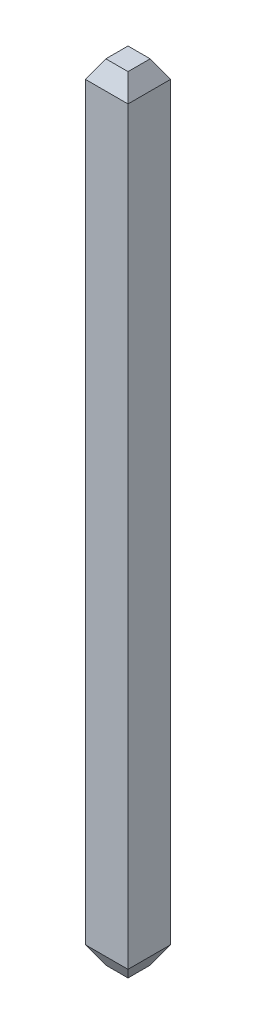
ISO-10303-21;
HEADER;
FILE_DESCRIPTION(('STEP AP214'),'2;1');
FILE_NAME('part.step','',(''),(''),'','','');
FILE_SCHEMA(('AUTOMOTIVE_DESIGN { 1 0 10303 214 1 1 1 1 }'));
ENDSEC;
DATA;
#1=APPLICATION_CONTEXT('core data for automotive mechanical design processes');
#2=APPLICATION_PROTOCOL_DEFINITION('international standard','automotive_design',2000,#1);
#3=PRODUCT_CONTEXT('',#1,'mechanical');
#4=PRODUCT('Part','Part','',(#3));
#5=PRODUCT_RELATED_PRODUCT_CATEGORY('part','',(#4));
#6=PRODUCT_DEFINITION_FORMATION('','',#4);
#7=PRODUCT_DEFINITION_CONTEXT('part definition',#1,'design');
#8=PRODUCT_DEFINITION('design','',#6,#7);
#9=PRODUCT_DEFINITION_SHAPE('','',#8);
#10=(LENGTH_UNIT() NAMED_UNIT(*) SI_UNIT(.MILLI.,.METRE.));
#11=(NAMED_UNIT(*) PLANE_ANGLE_UNIT() SI_UNIT($,.RADIAN.));
#12=(NAMED_UNIT(*) SI_UNIT($,.STERADIAN.) SOLID_ANGLE_UNIT());
#13=UNCERTAINTY_MEASURE_WITH_UNIT(LENGTH_MEASURE(1.E-05),#10,'distance_accuracy_value','');
#14=(GEOMETRIC_REPRESENTATION_CONTEXT(3) GLOBAL_UNCERTAINTY_ASSIGNED_CONTEXT((#13)) GLOBAL_UNIT_ASSIGNED_CONTEXT((#10,
#11,#12)) REPRESENTATION_CONTEXT('',''));
#15=CARTESIAN_POINT('',(0.,0.,0.));
#16=DIRECTION('',(0.,0.,1.));
#17=DIRECTION('',(1.,0.,0.));
#18=AXIS2_PLACEMENT_3D('',#15,#16,#17);
#19=CARTESIAN_POINT('',(2.2225,-5.58,-1.435));
#20=DIRECTION('',(0.,0.50000000000019,0.866025403784329));
#21=DIRECTION('',(1.,0.,0.));
#22=AXIS2_PLACEMENT_3D('',#19,#20,#21);
#23=PLANE('',#22);
#24=DIRECTION('',(-0.44721359550015,0.774596669241261,-0.44721359550015));
#25=VECTOR('',#24,1.);
#26=CARTESIAN_POINT('',(2.375,-5.58,-1.435));
#27=LINE('',#26,#25);
#28=CARTESIAN_POINT('',(2.375,-5.58,-1.435));
#29=VERTEX_POINT('',#28);
#30=CARTESIAN_POINT('',(2.2225,-5.31586225185,-1.5875));
#31=VERTEX_POINT('',#30);
#32=EDGE_CURVE('E161',#29,#31,#27,.T.);
#33=ORIENTED_EDGE('',*,*,#32,.T.);
#34=DIRECTION('',(1.,0.,0.));
#35=VECTOR('',#34,1.);
#36=CARTESIAN_POINT('',(2.2225,-5.31586225185,-1.5875));
#37=LINE('',#36,#35);
#38=CARTESIAN_POINT('',(2.8575,-5.31586225185,-1.5875));
#39=VERTEX_POINT('',#38);
#40=EDGE_CURVE('E148',#31,#39,#37,.T.);
#41=ORIENTED_EDGE('',*,*,#40,.T.);
#42=DIRECTION('',(0.44721359550015,0.774596669241261,-0.44721359550015));
#43=VECTOR('',#42,1.);
#44=CARTESIAN_POINT('',(2.705,-5.58,-1.435));
#45=LINE('',#44,#43);
#46=CARTESIAN_POINT('',(2.705,-5.58,-1.435));
#47=VERTEX_POINT('',#46);
#48=EDGE_CURVE('E27',#47,#39,#45,.T.);
#49=ORIENTED_EDGE('',*,*,#48,.F.);
#50=DIRECTION('',(1.,0.,0.));
#51=VECTOR('',#50,1.);
#52=CARTESIAN_POINT('',(2.375,-5.58,-1.435));
#53=LINE('',#52,#51);
#54=EDGE_CURVE('E156',#29,#47,#53,.T.);
#55=ORIENTED_EDGE('',*,*,#54,.F.);
#56=EDGE_LOOP('',(#33,#41,#49,#55));
#57=FACE_BOUND('',#56,.T.);
#58=ADVANCED_FACE('F16',(#57),#23,.F.);
#59=CARTESIAN_POINT('',(2.8575,-5.58,-1.105));
#60=DIRECTION('',(0.,0.50000000000019,-0.866025403784329));
#61=DIRECTION('',(-1.,0.,0.));
#62=AXIS2_PLACEMENT_3D('',#59,#60,#61);
#63=PLANE('',#62);
#64=DIRECTION('',(0.44721359550015,0.774596669241261,0.44721359550015));
#65=VECTOR('',#64,1.);
#66=CARTESIAN_POINT('',(2.705,-5.58,-1.105));
#67=LINE('',#66,#65);
#68=CARTESIAN_POINT('',(2.705,-5.58,-1.105));
#69=VERTEX_POINT('',#68);
#70=CARTESIAN_POINT('',(2.8575,-5.31586225185,-0.9525));
#71=VERTEX_POINT('',#70);
#72=EDGE_CURVE('E11',#69,#71,#67,.T.);
#73=ORIENTED_EDGE('',*,*,#72,.T.);
#74=DIRECTION('',(-1.,0.,0.));
#75=VECTOR('',#74,1.);
#76=CARTESIAN_POINT('',(2.8575,-5.31586225185,-0.9525));
#77=LINE('',#76,#75);
#78=CARTESIAN_POINT('',(2.2225,-5.31586225185,-0.9525));
#79=VERTEX_POINT('',#78);
#80=EDGE_CURVE('E209',#71,#79,#77,.T.);
#81=ORIENTED_EDGE('',*,*,#80,.T.);
#82=DIRECTION('',(-0.44721359550015,0.774596669241261,0.44721359550015));
#83=VECTOR('',#82,1.);
#84=CARTESIAN_POINT('',(2.375,-5.58,-1.105));
#85=LINE('',#84,#83);
#86=CARTESIAN_POINT('',(2.375,-5.58,-1.105));
#87=VERTEX_POINT('',#86);
#88=EDGE_CURVE('E165',#87,#79,#85,.T.);
#89=ORIENTED_EDGE('',*,*,#88,.F.);
#90=DIRECTION('',(-1.,0.,0.));
#91=VECTOR('',#90,1.);
#92=CARTESIAN_POINT('',(2.705,-5.58,-1.105));
#93=LINE('',#92,#91);
#94=EDGE_CURVE('E152',#69,#87,#93,.T.);
#95=ORIENTED_EDGE('',*,*,#94,.F.);
#96=EDGE_LOOP('',(#73,#81,#89,#95));
#97=FACE_BOUND('',#96,.T.);
#98=ADVANCED_FACE('F431',(#97),#63,.F.);
#99=CARTESIAN_POINT('',(2.705,-5.58,-1.5875));
#100=DIRECTION('',(-0.866025403784329,0.50000000000019,0.));
#101=DIRECTION('',(0.,0.,1.));
#102=AXIS2_PLACEMENT_3D('',#99,#100,#101);
#103=PLANE('',#102);
#104=ORIENTED_EDGE('',*,*,#48,.T.);
#105=DIRECTION('',(0.,0.,1.));
#106=VECTOR('',#105,1.);
#107=CARTESIAN_POINT('',(2.8575,-5.31586225185,-1.5875));
#108=LINE('',#107,#106);
#109=EDGE_CURVE('E20',#39,#71,#108,.T.);
#110=ORIENTED_EDGE('',*,*,#109,.T.);
#111=ORIENTED_EDGE('',*,*,#72,.F.);
#112=DIRECTION('',(0.,0.,1.));
#113=VECTOR('',#112,1.);
#114=CARTESIAN_POINT('',(2.705,-5.58,-1.435));
#115=LINE('',#114,#113);
#116=EDGE_CURVE('E166',#47,#69,#115,.T.);
#117=ORIENTED_EDGE('',*,*,#116,.F.);
#118=EDGE_LOOP('',(#104,#110,#111,#117));
#119=FACE_BOUND('',#118,.T.);
#120=ADVANCED_FACE('F18',(#119),#103,.F.);
#121=CARTESIAN_POINT('',(2.54,-5.58,-1.27));
#122=DIRECTION('',(0.,-1.,0.));
#123=DIRECTION('',(0.,0.,-1.));
#124=AXIS2_PLACEMENT_3D('',#121,#122,#123);
#125=PLANE('',#124);
#126=ORIENTED_EDGE('',*,*,#94,.T.);
#127=DIRECTION('',(0.,0.,-1.));
#128=VECTOR('',#127,1.);
#129=CARTESIAN_POINT('',(2.375,-5.58,-1.105));
#130=LINE('',#129,#128);
#131=EDGE_CURVE('E157',#87,#29,#130,.T.);
#132=ORIENTED_EDGE('',*,*,#131,.T.);
#133=ORIENTED_EDGE('',*,*,#54,.T.);
#134=ORIENTED_EDGE('',*,*,#116,.T.);
#135=EDGE_LOOP('',(#126,#132,#133,#134));
#136=FACE_BOUND('',#135,.T.);
#137=ADVANCED_FACE('F184',(#136),#125,.T.);
#138=CARTESIAN_POINT('',(2.375,-5.58,-0.9525));
#139=DIRECTION('',(0.866025403784329,0.50000000000019,0.));
#140=DIRECTION('',(0.,0.,-1.));
#141=AXIS2_PLACEMENT_3D('',#138,#139,#140);
#142=PLANE('',#141);
#143=ORIENTED_EDGE('',*,*,#88,.T.);
#144=DIRECTION('',(0.,0.,-1.));
#145=VECTOR('',#144,1.);
#146=CARTESIAN_POINT('',(2.2225,-5.31586225185,-0.9525));
#147=LINE('',#146,#145);
#148=EDGE_CURVE('E170',#79,#31,#147,.T.);
#149=ORIENTED_EDGE('',*,*,#148,.T.);
#150=ORIENTED_EDGE('',*,*,#32,.F.);
#151=ORIENTED_EDGE('',*,*,#131,.F.);
#152=EDGE_LOOP('',(#143,#149,#150,#151));
#153=FACE_BOUND('',#152,.T.);
#154=ADVANCED_FACE('F188',(#153),#142,.F.);
#155=CARTESIAN_POINT('',(2.2225,6.1,-0.9525));
#156=DIRECTION('',(-1.,0.,0.));
#157=DIRECTION('',(0.,0.,1.));
#158=AXIS2_PLACEMENT_3D('',#155,#156,#157);
#159=PLANE('',#158);
#160=DIRECTION('',(0.,-1.,0.));
#161=VECTOR('',#160,1.);
#162=CARTESIAN_POINT('',(2.2225,5.835862251846,-1.5875));
#163=LINE('',#162,#161);
#164=CARTESIAN_POINT('',(2.2225,5.835862251846,-1.5875));
#165=VERTEX_POINT('',#164);
#166=EDGE_CURVE('E79',#165,#31,#163,.T.);
#167=ORIENTED_EDGE('',*,*,#166,.T.);
#168=ORIENTED_EDGE('',*,*,#148,.F.);
#169=DIRECTION('',(0.,-1.,0.));
#170=VECTOR('',#169,1.);
#171=CARTESIAN_POINT('',(2.2225,5.835862251846,-0.9525));
#172=LINE('',#171,#170);
#173=CARTESIAN_POINT('',(2.2225,5.835862251846,-0.9525));
#174=VERTEX_POINT('',#173);
#175=EDGE_CURVE('E63',#174,#79,#172,.T.);
#176=ORIENTED_EDGE('',*,*,#175,.F.);
#177=DIRECTION('',(0.,0.,-1.));
#178=VECTOR('',#177,1.);
#179=CARTESIAN_POINT('',(2.2225,5.835862251846,-0.9525));
#180=LINE('',#179,#178);
#181=EDGE_CURVE('E175',#174,#165,#180,.T.);
#182=ORIENTED_EDGE('',*,*,#181,.T.);
#183=EDGE_LOOP('',(#167,#168,#176,#182));
#184=FACE_BOUND('',#183,.T.);
#185=ADVANCED_FACE('F398',(#184),#159,.T.);
#186=CARTESIAN_POINT('',(2.2225,6.1,-1.5875));
#187=DIRECTION('',(0.,0.,-1.));
#188=DIRECTION('',(0.,-1.,0.));
#189=AXIS2_PLACEMENT_3D('',#186,#187,#188);
#190=PLANE('',#189);
#191=DIRECTION('',(0.,-1.,0.));
#192=VECTOR('',#191,1.);
#193=CARTESIAN_POINT('',(2.8575,5.835862251846,-1.5875));
#194=LINE('',#193,#192);
#195=CARTESIAN_POINT('',(2.8575,5.835862251846,-1.5875));
#196=VERTEX_POINT('',#195);
#197=EDGE_CURVE('E151',#196,#39,#194,.T.);
#198=ORIENTED_EDGE('',*,*,#197,.T.);
#199=ORIENTED_EDGE('',*,*,#40,.F.);
#200=ORIENTED_EDGE('',*,*,#166,.F.);
#201=DIRECTION('',(1.,0.,0.));
#202=VECTOR('',#201,1.);
#203=CARTESIAN_POINT('',(2.2225,5.835862251846,-1.5875));
#204=LINE('',#203,#202);
#205=EDGE_CURVE('E117',#165,#196,#204,.T.);
#206=ORIENTED_EDGE('',*,*,#205,.T.);
#207=EDGE_LOOP('',(#198,#199,#200,#206));
#208=FACE_BOUND('',#207,.T.);
#209=ADVANCED_FACE('F241',(#208),#190,.T.);
#210=CARTESIAN_POINT('',(2.8575,6.1,-1.5875));
#211=DIRECTION('',(1.,0.,0.));
#212=DIRECTION('',(0.,1.,0.));
#213=AXIS2_PLACEMENT_3D('',#210,#211,#212);
#214=PLANE('',#213);
#215=DIRECTION('',(0.,-1.,0.));
#216=VECTOR('',#215,1.);
#217=CARTESIAN_POINT('',(2.8575,5.835862251846,-0.9525));
#218=LINE('',#217,#216);
#219=CARTESIAN_POINT('',(2.8575,5.835862251846,-0.9525));
#220=VERTEX_POINT('',#219);
#221=EDGE_CURVE('E205',#220,#71,#218,.T.);
#222=ORIENTED_EDGE('',*,*,#221,.T.);
#223=ORIENTED_EDGE('',*,*,#109,.F.);
#224=ORIENTED_EDGE('',*,*,#197,.F.);
#225=DIRECTION('',(0.,0.,1.));
#226=VECTOR('',#225,1.);
#227=CARTESIAN_POINT('',(2.8575,5.835862251846,-1.5875));
#228=LINE('',#227,#226);
#229=EDGE_CURVE('E112',#196,#220,#228,.T.);
#230=ORIENTED_EDGE('',*,*,#229,.T.);
#231=EDGE_LOOP('',(#222,#223,#224,#230));
#232=FACE_BOUND('',#231,.T.);
#233=ADVANCED_FACE('F216',(#232),#214,.T.);
#234=CARTESIAN_POINT('',(2.8575,6.1,-0.9525));
#235=DIRECTION('',(0.,0.,1.));
#236=DIRECTION('',(1.,0.,0.));
#237=AXIS2_PLACEMENT_3D('',#234,#235,#236);
#238=PLANE('',#237);
#239=ORIENTED_EDGE('',*,*,#175,.T.);
#240=ORIENTED_EDGE('',*,*,#80,.F.);
#241=ORIENTED_EDGE('',*,*,#221,.F.);
#242=DIRECTION('',(-1.,0.,0.));
#243=VECTOR('',#242,1.);
#244=CARTESIAN_POINT('',(2.8575,5.835862251846,-0.9525));
#245=LINE('',#244,#243);
#246=EDGE_CURVE('E141',#220,#174,#245,.T.);
#247=ORIENTED_EDGE('',*,*,#246,.T.);
#248=EDGE_LOOP('',(#239,#240,#241,#247));
#249=FACE_BOUND('',#248,.T.);
#250=ADVANCED_FACE('F207',(#249),#238,.T.);
#251=CARTESIAN_POINT('',(2.8575,6.1,-1.105));
#252=DIRECTION('',(0.,0.50000000000019,0.866025403784329));
#253=DIRECTION('',(1.,0.,0.));
#254=AXIS2_PLACEMENT_3D('',#251,#252,#253);
#255=PLANE('',#254);
#256=DIRECTION('',(-0.44721359550015,-0.774596669241261,0.44721359550015));
#257=VECTOR('',#256,1.);
#258=CARTESIAN_POINT('',(2.375,6.1,-1.105));
#259=LINE('',#258,#257);
#260=CARTESIAN_POINT('',(2.375,6.1,-1.105));
#261=VERTEX_POINT('',#260);
#262=EDGE_CURVE('E95',#261,#174,#259,.T.);
#263=ORIENTED_EDGE('',*,*,#262,.T.);
#264=ORIENTED_EDGE('',*,*,#246,.F.);
#265=DIRECTION('',(0.44721359550015,-0.774596669241261,0.44721359550015));
#266=VECTOR('',#265,1.);
#267=CARTESIAN_POINT('',(2.705,6.1,-1.105));
#268=LINE('',#267,#266);
#269=CARTESIAN_POINT('',(2.705,6.1,-1.105));
#270=VERTEX_POINT('',#269);
#271=EDGE_CURVE('E126',#270,#220,#268,.T.);
#272=ORIENTED_EDGE('',*,*,#271,.F.);
#273=DIRECTION('',(-1.,0.,0.));
#274=VECTOR('',#273,1.);
#275=CARTESIAN_POINT('',(2.705,6.1,-1.105));
#276=LINE('',#275,#274);
#277=EDGE_CURVE('E124',#270,#261,#276,.T.);
#278=ORIENTED_EDGE('',*,*,#277,.T.);
#279=EDGE_LOOP('',(#263,#264,#272,#278));
#280=FACE_BOUND('',#279,.T.);
#281=ADVANCED_FACE('F215',(#280),#255,.T.);
#282=CARTESIAN_POINT('',(2.375,6.1,-0.9525));
#283=DIRECTION('',(-0.866025403784329,0.50000000000019,0.));
#284=DIRECTION('',(0.,0.,1.));
#285=AXIS2_PLACEMENT_3D('',#282,#283,#284);
#286=PLANE('',#285);
#287=DIRECTION('',(-0.44721359550015,-0.774596669241261,-0.44721359550015));
#288=VECTOR('',#287,1.);
#289=CARTESIAN_POINT('',(2.375,6.1,-1.435));
#290=LINE('',#289,#288);
#291=CARTESIAN_POINT('',(2.375,6.1,-1.435));
#292=VERTEX_POINT('',#291);
#293=EDGE_CURVE('E130',#292,#165,#290,.T.);
#294=ORIENTED_EDGE('',*,*,#293,.T.);
#295=ORIENTED_EDGE('',*,*,#181,.F.);
#296=ORIENTED_EDGE('',*,*,#262,.F.);
#297=DIRECTION('',(0.,0.,-1.));
#298=VECTOR('',#297,1.);
#299=CARTESIAN_POINT('',(2.375,6.1,-1.105));
#300=LINE('',#299,#298);
#301=EDGE_CURVE('E132',#261,#292,#300,.T.);
#302=ORIENTED_EDGE('',*,*,#301,.T.);
#303=EDGE_LOOP('',(#294,#295,#296,#302));
#304=FACE_BOUND('',#303,.T.);
#305=ADVANCED_FACE('F240',(#304),#286,.T.);
#306=CARTESIAN_POINT('',(2.2225,6.1,-1.435));
#307=DIRECTION('',(0.,0.50000000000019,-0.866025403784329));
#308=DIRECTION('',(-1.,0.,0.));
#309=AXIS2_PLACEMENT_3D('',#306,#307,#308);
#310=PLANE('',#309);
#311=DIRECTION('',(0.44721359550015,-0.774596669241261,-0.44721359550015));
#312=VECTOR('',#311,1.);
#313=CARTESIAN_POINT('',(2.705,6.1,-1.435));
#314=LINE('',#313,#312);
#315=CARTESIAN_POINT('',(2.705,6.1,-1.435));
#316=VERTEX_POINT('',#315);
#317=EDGE_CURVE('E105',#316,#196,#314,.T.);
#318=ORIENTED_EDGE('',*,*,#317,.T.);
#319=ORIENTED_EDGE('',*,*,#205,.F.);
#320=ORIENTED_EDGE('',*,*,#293,.F.);
#321=DIRECTION('',(1.,0.,0.));
#322=VECTOR('',#321,1.);
#323=CARTESIAN_POINT('',(2.375,6.1,-1.435));
#324=LINE('',#323,#322);
#325=EDGE_CURVE('E123',#292,#316,#324,.T.);
#326=ORIENTED_EDGE('',*,*,#325,.T.);
#327=EDGE_LOOP('',(#318,#319,#320,#326));
#328=FACE_BOUND('',#327,.T.);
#329=ADVANCED_FACE('F128',(#328),#310,.T.);
#330=CARTESIAN_POINT('',(2.705,6.1,-1.5875));
#331=DIRECTION('',(0.866025403784329,0.50000000000019,0.));
#332=DIRECTION('',(0.,0.,-1.));
#333=AXIS2_PLACEMENT_3D('',#330,#331,#332);
#334=PLANE('',#333);
#335=ORIENTED_EDGE('',*,*,#271,.T.);
#336=ORIENTED_EDGE('',*,*,#229,.F.);
#337=ORIENTED_EDGE('',*,*,#317,.F.);
#338=DIRECTION('',(0.,0.,1.));
#339=VECTOR('',#338,1.);
#340=CARTESIAN_POINT('',(2.705,6.1,-1.435));
#341=LINE('',#340,#339);
#342=EDGE_CURVE('E109',#316,#270,#341,.T.);
#343=ORIENTED_EDGE('',*,*,#342,.T.);
#344=EDGE_LOOP('',(#335,#336,#337,#343));
#345=FACE_BOUND('',#344,.T.);
#346=ADVANCED_FACE('F108',(#345),#334,.T.);
#347=CARTESIAN_POINT('',(2.54,6.1,-1.27));
#348=DIRECTION('',(0.,-1.,0.));
#349=DIRECTION('',(0.,0.,-1.));
#350=AXIS2_PLACEMENT_3D('',#347,#348,#349);
#351=PLANE('',#350);
#352=ORIENTED_EDGE('',*,*,#325,.F.);
#353=ORIENTED_EDGE('',*,*,#301,.F.);
#354=ORIENTED_EDGE('',*,*,#277,.F.);
#355=ORIENTED_EDGE('',*,*,#342,.F.);
#356=EDGE_LOOP('',(#352,#353,#354,#355));
#357=FACE_BOUND('',#356,.T.);
#358=ADVANCED_FACE('F121',(#357),#351,.F.);
#359=CLOSED_SHELL('',(#58,#98,#120,#137,#154,#185,#209,#233,#250,#281,#305,#329,#346,#358));
#360=MANIFOLD_SOLID_BREP('B1',#359);
#361=ADVANCED_BREP_SHAPE_REPRESENTATION('',(#18,#360),#14);
#362=SHAPE_DEFINITION_REPRESENTATION(#9,#361);
ENDSEC;
END-ISO-10303-21;
